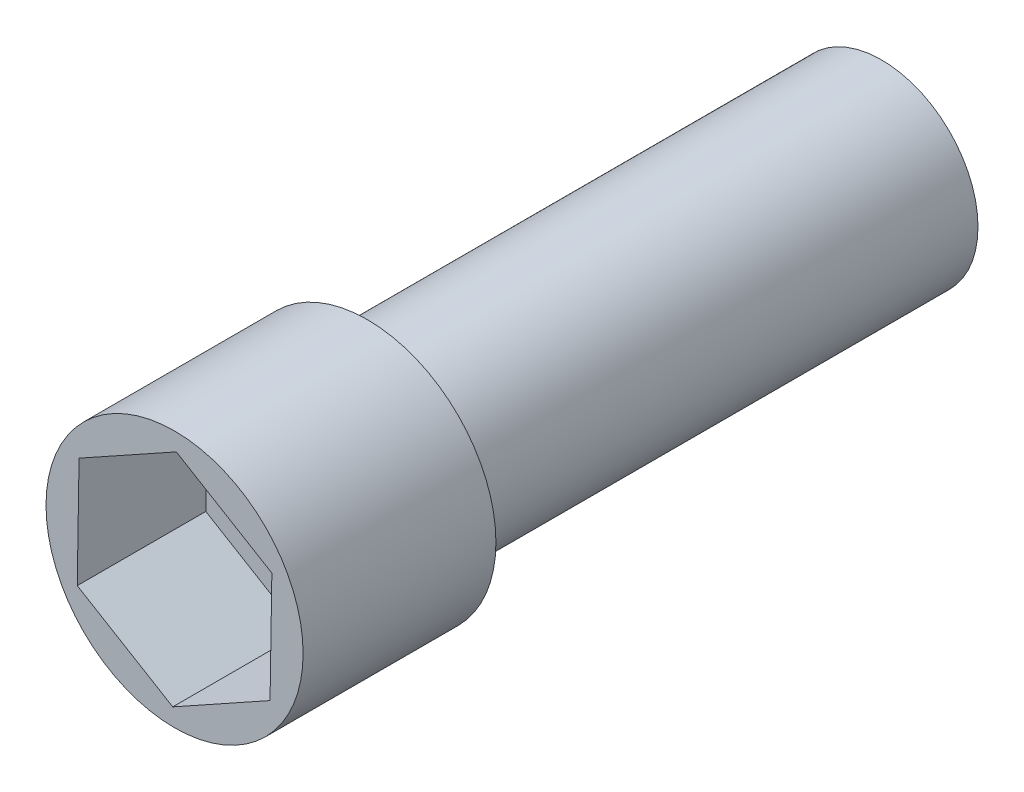
ISO-10303-21;
HEADER;
FILE_DESCRIPTION(('STEP AP214'),'2;1');
FILE_NAME('part.step','',(''),(''),'','','');
FILE_SCHEMA(('AUTOMOTIVE_DESIGN { 1 0 10303 214 1 1 1 1 }'));
ENDSEC;
DATA;
#1=APPLICATION_CONTEXT('core data for automotive mechanical design processes');
#2=APPLICATION_PROTOCOL_DEFINITION('international standard','automotive_design',2000,#1);
#3=PRODUCT_CONTEXT('',#1,'mechanical');
#4=PRODUCT('Part','Part','',(#3));
#5=PRODUCT_RELATED_PRODUCT_CATEGORY('part','',(#4));
#6=PRODUCT_DEFINITION_FORMATION('','',#4);
#7=PRODUCT_DEFINITION_CONTEXT('part definition',#1,'design');
#8=PRODUCT_DEFINITION('design','',#6,#7);
#9=PRODUCT_DEFINITION_SHAPE('','',#8);
#10=(LENGTH_UNIT() NAMED_UNIT(*) SI_UNIT(.MILLI.,.METRE.));
#11=(NAMED_UNIT(*) PLANE_ANGLE_UNIT() SI_UNIT($,.RADIAN.));
#12=(NAMED_UNIT(*) SI_UNIT($,.STERADIAN.) SOLID_ANGLE_UNIT());
#13=UNCERTAINTY_MEASURE_WITH_UNIT(LENGTH_MEASURE(1.E-05),#10,'distance_accuracy_value','');
#14=(GEOMETRIC_REPRESENTATION_CONTEXT(3) GLOBAL_UNCERTAINTY_ASSIGNED_CONTEXT((#13)) GLOBAL_UNIT_ASSIGNED_CONTEXT((#10,
#11,#12)) REPRESENTATION_CONTEXT('',''));
#15=CARTESIAN_POINT('',(0.,0.,0.));
#16=DIRECTION('',(0.,0.,1.));
#17=DIRECTION('',(1.,0.,0.));
#18=AXIS2_PLACEMENT_3D('',#15,#16,#17);
#19=CARTESIAN_POINT('',(0.,0.,-3.));
#20=DIRECTION('',(0.,0.,1.));
#21=DIRECTION('',(-1.,0.,0.));
#22=AXIS2_PLACEMENT_3D('',#19,#20,#21);
#23=CYLINDRICAL_SURFACE('',#22,2.);
#24=CARTESIAN_POINT('',(0.,0.,-3.));
#25=DIRECTION('',(0.,0.,1.));
#26=DIRECTION('',(1.,0.,0.));
#27=AXIS2_PLACEMENT_3D('',#24,#25,#26);
#28=CIRCLE('',#27,2.);
#29=CARTESIAN_POINT('',(2.,0.,-3.));
#30=VERTEX_POINT('',#29);
#31=EDGE_CURVE('E11',#30,#30,#28,.T.);
#32=ORIENTED_EDGE('',*,*,#31,.T.);
#33=EDGE_LOOP('',(#32));
#34=FACE_BOUND('',#33,.T.);
#35=CARTESIAN_POINT('',(0.,0.,0.));
#36=DIRECTION('',(0.,0.,1.));
#37=DIRECTION('',(1.,0.,0.));
#38=AXIS2_PLACEMENT_3D('',#35,#36,#37);
#39=CIRCLE('',#38,2.);
#40=CARTESIAN_POINT('',(2.,0.,0.));
#41=VERTEX_POINT('',#40);
#42=EDGE_CURVE('E40',#41,#41,#39,.T.);
#43=ORIENTED_EDGE('',*,*,#42,.F.);
#44=EDGE_LOOP('',(#43));
#45=FACE_BOUND('',#44,.T.);
#46=ADVANCED_FACE('F37',(#34,#45),#23,.T.);
#47=CARTESIAN_POINT('',(0.,0.,-3.));
#48=DIRECTION('',(0.,0.,-1.));
#49=DIRECTION('',(1.,0.,0.));
#50=AXIS2_PLACEMENT_3D('',#47,#48,#49);
#51=PLANE('',#50);
#52=CARTESIAN_POINT('',(0.,0.,-3.));
#53=DIRECTION('',(0.,0.,1.));
#54=DIRECTION('',(1.,0.,0.));
#55=AXIS2_PLACEMENT_3D('',#52,#53,#54);
#56=CIRCLE('',#55,1.5);
#57=CARTESIAN_POINT('',(1.5,0.,-3.));
#58=VERTEX_POINT('',#57);
#59=EDGE_CURVE('E128',#58,#58,#56,.T.);
#60=ORIENTED_EDGE('',*,*,#59,.T.);
#61=EDGE_LOOP('',(#60));
#62=FACE_BOUND('',#61,.T.);
#63=ORIENTED_EDGE('',*,*,#31,.F.);
#64=EDGE_LOOP('',(#63));
#65=FACE_BOUND('',#64,.T.);
#66=ADVANCED_FACE('F168',(#62,#65),#51,.T.);
#67=CARTESIAN_POINT('',(0.,0.,0.));
#68=DIRECTION('',(0.,0.,-1.));
#69=DIRECTION('',(1.,0.,0.));
#70=AXIS2_PLACEMENT_3D('',#67,#68,#69);
#71=PLANE('',#70);
#72=DIRECTION('',(0.0162359142624325,0.999868188856943,0.));
#73=VECTOR('',#72,1.);
#74=CARTESIAN_POINT('',(-1.51386299749035,-0.8415573805924,0.));
#75=LINE('',#74,#73);
#76=CARTESIAN_POINT('',(-1.51386299749035,-0.8415573805924,0.));
#77=VERTEX_POINT('',#76);
#78=CARTESIAN_POINT('',(-1.48574156908048,0.890265123379698,0.));
#79=VERTEX_POINT('',#78);
#80=EDGE_CURVE('E143',#77,#79,#75,.T.);
#81=ORIENTED_EDGE('',*,*,#80,.T.);
#82=DIRECTION('',(0.874029209117265,0.485873380223539,0.));
#83=VECTOR('',#82,1.);
#84=CARTESIAN_POINT('',(-1.48574156908048,0.890265123379698,0.));
#85=LINE('',#84,#83);
#86=CARTESIAN_POINT('',(0.0281214284098654,1.7318225039721,0.));
#87=VERTEX_POINT('',#86);
#88=EDGE_CURVE('E140',#79,#87,#85,.T.);
#89=ORIENTED_EDGE('',*,*,#88,.T.);
#90=DIRECTION('',(0.857793294854833,-0.513994808633404,0.));
#91=VECTOR('',#90,1.);
#92=CARTESIAN_POINT('',(0.0281214284098654,1.7318225039721,0.));
#93=LINE('',#92,#91);
#94=CARTESIAN_POINT('',(1.51386299749035,0.8415573805924,0.));
#95=VERTEX_POINT('',#94);
#96=EDGE_CURVE('E138',#87,#95,#93,.T.);
#97=ORIENTED_EDGE('',*,*,#96,.T.);
#98=DIRECTION('',(-0.0162359142624327,-0.999868188856943,0.));
#99=VECTOR('',#98,1.);
#100=CARTESIAN_POINT('',(1.51386299749035,0.8415573805924,0.));
#101=LINE('',#100,#99);
#102=CARTESIAN_POINT('',(1.48574156908048,-0.890265123379698,0.));
#103=VERTEX_POINT('',#102);
#104=EDGE_CURVE('E114',#95,#103,#101,.T.);
#105=ORIENTED_EDGE('',*,*,#104,.T.);
#106=DIRECTION('',(-0.874029209117265,-0.485873380223539,0.));
#107=VECTOR('',#106,1.);
#108=CARTESIAN_POINT('',(1.48574156908048,-0.890265123379698,0.));
#109=LINE('',#108,#107);
#110=CARTESIAN_POINT('',(-0.0281214284098656,-1.7318225039721,0.));
#111=VERTEX_POINT('',#110);
#112=EDGE_CURVE('E133',#103,#111,#109,.T.);
#113=ORIENTED_EDGE('',*,*,#112,.T.);
#114=DIRECTION('',(-0.857793294854833,0.513994808633405,0.));
#115=VECTOR('',#114,1.);
#116=CARTESIAN_POINT('',(-0.0281214284098656,-1.7318225039721,0.));
#117=LINE('',#116,#115);
#118=EDGE_CURVE('E146',#111,#77,#117,.T.);
#119=ORIENTED_EDGE('',*,*,#118,.T.);
#120=EDGE_LOOP('',(#81,#89,#97,#105,#113,#119));
#121=FACE_BOUND('',#120,.T.);
#122=ORIENTED_EDGE('',*,*,#42,.T.);
#123=EDGE_LOOP('',(#122));
#124=FACE_BOUND('',#123,.T.);
#125=ADVANCED_FACE('F154',(#121,#124),#71,.F.);
#126=CARTESIAN_POINT('',(0.,0.,-11.));
#127=DIRECTION('',(0.,0.,1.));
#128=DIRECTION('',(-1.,0.,0.));
#129=AXIS2_PLACEMENT_3D('',#126,#127,#128);
#130=CYLINDRICAL_SURFACE('',#129,1.5);
#131=CARTESIAN_POINT('',(0.,0.,-11.));
#132=DIRECTION('',(0.,0.,1.));
#133=DIRECTION('',(1.,0.,0.));
#134=AXIS2_PLACEMENT_3D('',#131,#132,#133);
#135=CIRCLE('',#134,1.5);
#136=CARTESIAN_POINT('',(1.5,0.,-11.));
#137=VERTEX_POINT('',#136);
#138=EDGE_CURVE('E125',#137,#137,#135,.T.);
#139=ORIENTED_EDGE('',*,*,#138,.T.);
#140=EDGE_LOOP('',(#139));
#141=FACE_BOUND('',#140,.T.);
#142=ORIENTED_EDGE('',*,*,#59,.F.);
#143=EDGE_LOOP('',(#142));
#144=FACE_BOUND('',#143,.T.);
#145=ADVANCED_FACE('F179',(#141,#144),#130,.T.);
#146=CARTESIAN_POINT('',(0.,0.,-11.));
#147=DIRECTION('',(0.,0.,-1.));
#148=DIRECTION('',(1.,0.,0.));
#149=AXIS2_PLACEMENT_3D('',#146,#147,#148);
#150=PLANE('',#149);
#151=ORIENTED_EDGE('',*,*,#138,.F.);
#152=EDGE_LOOP('',(#151));
#153=FACE_BOUND('',#152,.T.);
#154=ADVANCED_FACE('F164',(#153),#150,.T.);
#155=CARTESIAN_POINT('',(-0.0281214284098656,-1.7318225039721,-2.));
#156=DIRECTION('',(-0.513994808633405,-0.857793294854833,0.));
#157=DIRECTION('',(0.857793294854833,-0.513994808633405,0.));
#158=AXIS2_PLACEMENT_3D('',#155,#156,#157);
#159=PLANE('',#158);
#160=ORIENTED_EDGE('',*,*,#118,.F.);
#161=DIRECTION('',(0.,0.,1.));
#162=VECTOR('',#161,1.);
#163=CARTESIAN_POINT('',(-0.0281214284098656,-1.7318225039721,-2.));
#164=LINE('',#163,#162);
#165=CARTESIAN_POINT('',(-0.0281214284098656,-1.7318225039721,-2.));
#166=VERTEX_POINT('',#165);
#167=EDGE_CURVE('E82',#166,#111,#164,.T.);
#168=ORIENTED_EDGE('',*,*,#167,.F.);
#169=DIRECTION('',(-0.857793294854833,0.513994808633405,0.));
#170=VECTOR('',#169,1.);
#171=CARTESIAN_POINT('',(-0.0281214284098656,-1.7318225039721,-2.));
#172=LINE('',#171,#170);
#173=CARTESIAN_POINT('',(-1.51386299749035,-0.8415573805924,-2.));
#174=VERTEX_POINT('',#173);
#175=EDGE_CURVE('E136',#166,#174,#172,.T.);
#176=ORIENTED_EDGE('',*,*,#175,.T.);
#177=DIRECTION('',(0.,0.,1.));
#178=VECTOR('',#177,1.);
#179=CARTESIAN_POINT('',(-1.51386299749035,-0.8415573805924,-2.));
#180=LINE('',#179,#178);
#181=EDGE_CURVE('E51',#174,#77,#180,.T.);
#182=ORIENTED_EDGE('',*,*,#181,.T.);
#183=EDGE_LOOP('',(#160,#168,#176,#182));
#184=FACE_BOUND('',#183,.T.);
#185=ADVANCED_FACE('F151',(#184),#159,.F.);
#186=CARTESIAN_POINT('',(1.48574156908048,-0.890265123379698,-2.));
#187=DIRECTION('',(0.485873380223539,-0.874029209117265,0.));
#188=DIRECTION('',(0.874029209117265,0.485873380223539,0.));
#189=AXIS2_PLACEMENT_3D('',#186,#187,#188);
#190=PLANE('',#189);
#191=ORIENTED_EDGE('',*,*,#112,.F.);
#192=DIRECTION('',(0.,0.,1.));
#193=VECTOR('',#192,1.);
#194=CARTESIAN_POINT('',(1.48574156908048,-0.890265123379698,-2.));
#195=LINE('',#194,#193);
#196=CARTESIAN_POINT('',(1.48574156908048,-0.890265123379698,-2.));
#197=VERTEX_POINT('',#196);
#198=EDGE_CURVE('E116',#197,#103,#195,.T.);
#199=ORIENTED_EDGE('',*,*,#198,.F.);
#200=DIRECTION('',(-0.874029209117265,-0.485873380223539,0.));
#201=VECTOR('',#200,1.);
#202=CARTESIAN_POINT('',(1.48574156908048,-0.890265123379698,-2.));
#203=LINE('',#202,#201);
#204=EDGE_CURVE('E60',#197,#166,#203,.T.);
#205=ORIENTED_EDGE('',*,*,#204,.T.);
#206=ORIENTED_EDGE('',*,*,#167,.T.);
#207=EDGE_LOOP('',(#191,#199,#205,#206));
#208=FACE_BOUND('',#207,.T.);
#209=ADVANCED_FACE('F156',(#208),#190,.F.);
#210=CARTESIAN_POINT('',(1.51386299749035,0.8415573805924,-2.));
#211=DIRECTION('',(0.999868188856943,-0.0162359142624327,0.));
#212=DIRECTION('',(0.0162359142624327,0.999868188856943,0.));
#213=AXIS2_PLACEMENT_3D('',#210,#211,#212);
#214=PLANE('',#213);
#215=ORIENTED_EDGE('',*,*,#104,.F.);
#216=DIRECTION('',(0.,0.,1.));
#217=VECTOR('',#216,1.);
#218=CARTESIAN_POINT('',(1.51386299749035,0.8415573805924,-2.));
#219=LINE('',#218,#217);
#220=CARTESIAN_POINT('',(1.51386299749035,0.8415573805924,-2.));
#221=VERTEX_POINT('',#220);
#222=EDGE_CURVE('E103',#221,#95,#219,.T.);
#223=ORIENTED_EDGE('',*,*,#222,.F.);
#224=DIRECTION('',(-0.0162359142624327,-0.999868188856943,0.));
#225=VECTOR('',#224,1.);
#226=CARTESIAN_POINT('',(1.51386299749035,0.8415573805924,-2.));
#227=LINE('',#226,#225);
#228=EDGE_CURVE('E106',#221,#197,#227,.T.);
#229=ORIENTED_EDGE('',*,*,#228,.T.);
#230=ORIENTED_EDGE('',*,*,#198,.T.);
#231=EDGE_LOOP('',(#215,#223,#229,#230));
#232=FACE_BOUND('',#231,.T.);
#233=ADVANCED_FACE('F112',(#232),#214,.F.);
#234=CARTESIAN_POINT('',(0.0281214284098654,1.7318225039721,-2.));
#235=DIRECTION('',(0.513994808633404,0.857793294854833,0.));
#236=DIRECTION('',(-0.857793294854833,0.513994808633404,0.));
#237=AXIS2_PLACEMENT_3D('',#234,#235,#236);
#238=PLANE('',#237);
#239=ORIENTED_EDGE('',*,*,#96,.F.);
#240=DIRECTION('',(0.,0.,1.));
#241=VECTOR('',#240,1.);
#242=CARTESIAN_POINT('',(0.0281214284098654,1.7318225039721,-2.));
#243=LINE('',#242,#241);
#244=CARTESIAN_POINT('',(0.0281214284098654,1.7318225039721,-2.));
#245=VERTEX_POINT('',#244);
#246=EDGE_CURVE('E105',#245,#87,#243,.T.);
#247=ORIENTED_EDGE('',*,*,#246,.F.);
#248=DIRECTION('',(0.857793294854833,-0.513994808633404,0.));
#249=VECTOR('',#248,1.);
#250=CARTESIAN_POINT('',(0.0281214284098654,1.7318225039721,-2.));
#251=LINE('',#250,#249);
#252=EDGE_CURVE('E98',#245,#221,#251,.T.);
#253=ORIENTED_EDGE('',*,*,#252,.T.);
#254=ORIENTED_EDGE('',*,*,#222,.T.);
#255=EDGE_LOOP('',(#239,#247,#253,#254));
#256=FACE_BOUND('',#255,.T.);
#257=ADVANCED_FACE('F101',(#256),#238,.F.);
#258=CARTESIAN_POINT('',(-1.48574156908048,0.890265123379698,-2.));
#259=DIRECTION('',(-0.485873380223539,0.874029209117266,0.));
#260=DIRECTION('',(-0.874029209117266,-0.485873380223539,0.));
#261=AXIS2_PLACEMENT_3D('',#258,#259,#260);
#262=PLANE('',#261);
#263=ORIENTED_EDGE('',*,*,#88,.F.);
#264=DIRECTION('',(0.,0.,1.));
#265=VECTOR('',#264,1.);
#266=CARTESIAN_POINT('',(-1.48574156908048,0.890265123379698,-2.));
#267=LINE('',#266,#265);
#268=CARTESIAN_POINT('',(-1.48574156908048,0.890265123379698,-2.));
#269=VERTEX_POINT('',#268);
#270=EDGE_CURVE('E119',#269,#79,#267,.T.);
#271=ORIENTED_EDGE('',*,*,#270,.F.);
#272=DIRECTION('',(0.874029209117265,0.485873380223539,0.));
#273=VECTOR('',#272,1.);
#274=CARTESIAN_POINT('',(-1.48574156908048,0.890265123379698,-2.));
#275=LINE('',#274,#273);
#276=EDGE_CURVE('E107',#269,#245,#275,.T.);
#277=ORIENTED_EDGE('',*,*,#276,.T.);
#278=ORIENTED_EDGE('',*,*,#246,.T.);
#279=EDGE_LOOP('',(#263,#271,#277,#278));
#280=FACE_BOUND('',#279,.T.);
#281=ADVANCED_FACE('F192',(#280),#262,.F.);
#282=CARTESIAN_POINT('',(-1.51386299749035,-0.8415573805924,-2.));
#283=DIRECTION('',(-0.999868188856943,0.0162359142624325,0.));
#284=DIRECTION('',(-0.0162359142624325,-0.999868188856943,0.));
#285=AXIS2_PLACEMENT_3D('',#282,#283,#284);
#286=PLANE('',#285);
#287=ORIENTED_EDGE('',*,*,#80,.F.);
#288=ORIENTED_EDGE('',*,*,#181,.F.);
#289=DIRECTION('',(0.0162359142624325,0.999868188856943,0.));
#290=VECTOR('',#289,1.);
#291=CARTESIAN_POINT('',(-1.51386299749035,-0.8415573805924,-2.));
#292=LINE('',#291,#290);
#293=EDGE_CURVE('E89',#174,#269,#292,.T.);
#294=ORIENTED_EDGE('',*,*,#293,.T.);
#295=ORIENTED_EDGE('',*,*,#270,.T.);
#296=EDGE_LOOP('',(#287,#288,#294,#295));
#297=FACE_BOUND('',#296,.T.);
#298=ADVANCED_FACE('F189',(#297),#286,.F.);
#299=CARTESIAN_POINT('',(0.,0.,-2.));
#300=DIRECTION('',(0.,0.,1.));
#301=DIRECTION('',(-1.,0.,0.));
#302=AXIS2_PLACEMENT_3D('',#299,#300,#301);
#303=PLANE('',#302);
#304=ORIENTED_EDGE('',*,*,#175,.F.);
#305=ORIENTED_EDGE('',*,*,#204,.F.);
#306=ORIENTED_EDGE('',*,*,#228,.F.);
#307=ORIENTED_EDGE('',*,*,#252,.F.);
#308=ORIENTED_EDGE('',*,*,#276,.F.);
#309=ORIENTED_EDGE('',*,*,#293,.F.);
#310=EDGE_LOOP('',(#304,#305,#306,#307,#308,#309));
#311=FACE_BOUND('',#310,.T.);
#312=ADVANCED_FACE('F109',(#311),#303,.T.);
#313=CLOSED_SHELL('',(#46,#66,#125,#145,#154,#185,#209,#233,#257,#281,#298,#312));
#314=MANIFOLD_SOLID_BREP('B2',#313);
#315=ADVANCED_BREP_SHAPE_REPRESENTATION('',(#18,#314),#14);
#316=SHAPE_DEFINITION_REPRESENTATION(#9,#315);
ENDSEC;
END-ISO-10303-21;
